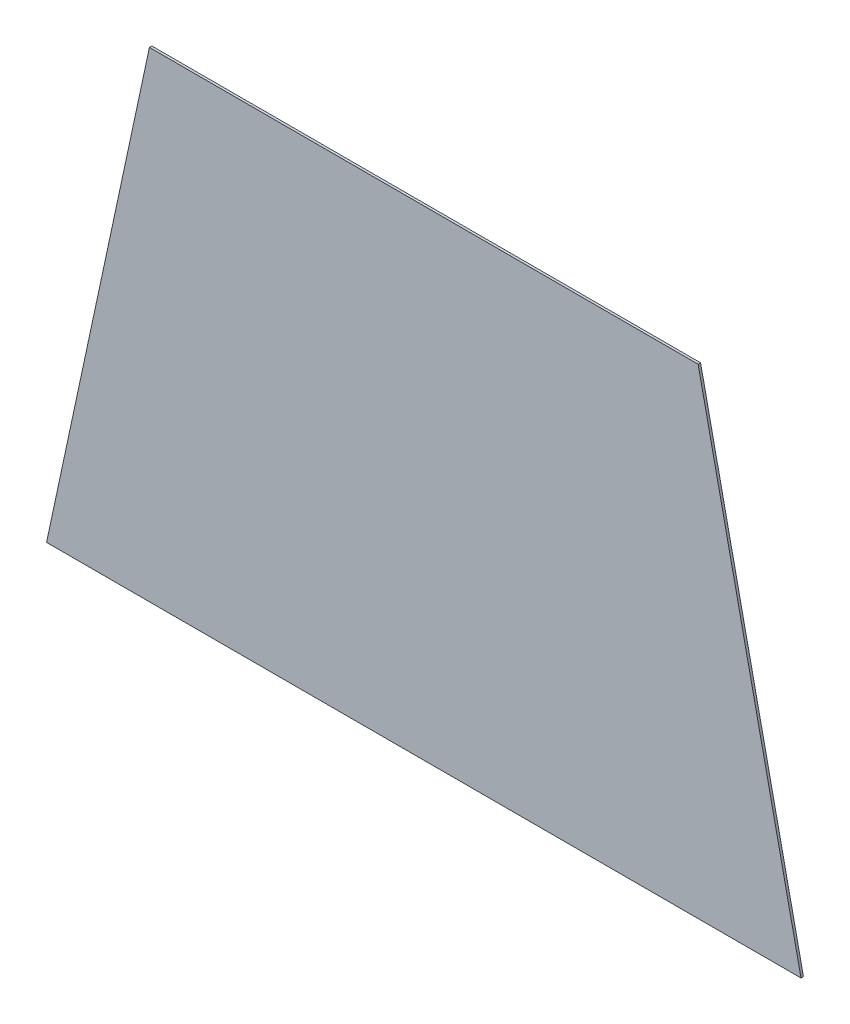
ISO-10303-21;
HEADER;
FILE_DESCRIPTION(('STEP AP214'),'2;1');
FILE_NAME('part.step','',(''),(''),'','','');
FILE_SCHEMA(('AUTOMOTIVE_DESIGN { 1 0 10303 214 1 1 1 1 }'));
ENDSEC;
DATA;
#1=APPLICATION_CONTEXT('core data for automotive mechanical design processes');
#2=APPLICATION_PROTOCOL_DEFINITION('international standard','automotive_design',2000,#1);
#3=PRODUCT_CONTEXT('',#1,'mechanical');
#4=PRODUCT('Part','Part','',(#3));
#5=PRODUCT_RELATED_PRODUCT_CATEGORY('part','',(#4));
#6=PRODUCT_DEFINITION_FORMATION('','',#4);
#7=PRODUCT_DEFINITION_CONTEXT('part definition',#1,'design');
#8=PRODUCT_DEFINITION('design','',#6,#7);
#9=PRODUCT_DEFINITION_SHAPE('','',#8);
#10=(LENGTH_UNIT() NAMED_UNIT(*) SI_UNIT(.MILLI.,.METRE.));
#11=(NAMED_UNIT(*) PLANE_ANGLE_UNIT() SI_UNIT($,.RADIAN.));
#12=(NAMED_UNIT(*) SI_UNIT($,.STERADIAN.) SOLID_ANGLE_UNIT());
#13=UNCERTAINTY_MEASURE_WITH_UNIT(LENGTH_MEASURE(1.E-05),#10,'distance_accuracy_value','');
#14=(GEOMETRIC_REPRESENTATION_CONTEXT(3) GLOBAL_UNCERTAINTY_ASSIGNED_CONTEXT((#13)) GLOBAL_UNIT_ASSIGNED_CONTEXT((#10,
#11,#12)) REPRESENTATION_CONTEXT('',''));
#15=CARTESIAN_POINT('',(0.,0.,0.));
#16=DIRECTION('',(0.,0.,1.));
#17=DIRECTION('',(1.,0.,0.));
#18=AXIS2_PLACEMENT_3D('',#15,#16,#17);
#19=CARTESIAN_POINT('',(177.8,311.15,0.));
#20=DIRECTION('',(0.97780241407741,0.209529088730873,0.));
#21=DIRECTION('',(-0.209529088730873,0.97780241407741,0.));
#22=AXIS2_PLACEMENT_3D('',#19,#20,#21);
#23=PLANE('',#22);
#24=DIRECTION('',(0.209529088730873,-0.97780241407741,0.));
#25=VECTOR('',#24,1.);
#26=CARTESIAN_POINT('',(177.8,311.15,1.5875));
#27=LINE('',#26,#25);
#28=CARTESIAN_POINT('',(177.8,311.15,1.5875));
#29=VERTEX_POINT('',#28);
#30=CARTESIAN_POINT('',(244.475,0.,1.5875));
#31=VERTEX_POINT('',#30);
#32=EDGE_CURVE('E9',#29,#31,#27,.T.);
#33=ORIENTED_EDGE('',*,*,#32,.T.);
#34=DIRECTION('',(0.,0.,1.));
#35=VECTOR('',#34,1.);
#36=CARTESIAN_POINT('',(244.475,0.,0.));
#37=LINE('',#36,#35);
#38=CARTESIAN_POINT('',(244.475,0.,0.));
#39=VERTEX_POINT('',#38);
#40=EDGE_CURVE('E34',#39,#31,#37,.T.);
#41=ORIENTED_EDGE('',*,*,#40,.F.);
#42=DIRECTION('',(0.209529088730873,-0.97780241407741,0.));
#43=VECTOR('',#42,1.);
#44=CARTESIAN_POINT('',(177.8,311.15,0.));
#45=LINE('',#44,#43);
#46=CARTESIAN_POINT('',(177.8,311.15,0.));
#47=VERTEX_POINT('',#46);
#48=EDGE_CURVE('E74',#47,#39,#45,.T.);
#49=ORIENTED_EDGE('',*,*,#48,.F.);
#50=DIRECTION('',(0.,0.,1.));
#51=VECTOR('',#50,1.);
#52=CARTESIAN_POINT('',(177.8,311.15,0.));
#53=LINE('',#52,#51);
#54=EDGE_CURVE('E25',#47,#29,#53,.T.);
#55=ORIENTED_EDGE('',*,*,#54,.T.);
#56=EDGE_LOOP('',(#33,#41,#49,#55));
#57=FACE_BOUND('',#56,.T.);
#58=ADVANCED_FACE('F15',(#57),#23,.T.);
#59=CARTESIAN_POINT('',(244.475,0.,0.));
#60=DIRECTION('',(0.,-1.,0.));
#61=DIRECTION('',(0.,0.,-1.));
#62=AXIS2_PLACEMENT_3D('',#59,#60,#61);
#63=PLANE('',#62);
#64=DIRECTION('',(-1.,0.,0.));
#65=VECTOR('',#64,1.);
#66=CARTESIAN_POINT('',(244.475,0.,1.5875));
#67=LINE('',#66,#65);
#68=CARTESIAN_POINT('',(-244.475,0.,1.5875));
#69=VERTEX_POINT('',#68);
#70=EDGE_CURVE('E80',#31,#69,#67,.T.);
#71=ORIENTED_EDGE('',*,*,#70,.T.);
#72=DIRECTION('',(0.,0.,1.));
#73=VECTOR('',#72,1.);
#74=CARTESIAN_POINT('',(-244.475,0.,0.));
#75=LINE('',#74,#73);
#76=CARTESIAN_POINT('',(-244.475,0.,0.));
#77=VERTEX_POINT('',#76);
#78=EDGE_CURVE('E82',#77,#69,#75,.T.);
#79=ORIENTED_EDGE('',*,*,#78,.F.);
#80=DIRECTION('',(-1.,0.,0.));
#81=VECTOR('',#80,1.);
#82=CARTESIAN_POINT('',(244.475,0.,0.));
#83=LINE('',#82,#81);
#84=EDGE_CURVE('E61',#39,#77,#83,.T.);
#85=ORIENTED_EDGE('',*,*,#84,.F.);
#86=ORIENTED_EDGE('',*,*,#40,.T.);
#87=EDGE_LOOP('',(#71,#79,#85,#86));
#88=FACE_BOUND('',#87,.T.);
#89=ADVANCED_FACE('F89',(#88),#63,.T.);
#90=CARTESIAN_POINT('',(-244.475,0.,0.));
#91=DIRECTION('',(-0.97780241407741,0.209529088730873,0.));
#92=DIRECTION('',(-0.209529088730873,-0.97780241407741,0.));
#93=AXIS2_PLACEMENT_3D('',#90,#91,#92);
#94=PLANE('',#93);
#95=DIRECTION('',(0.209529088730873,0.97780241407741,0.));
#96=VECTOR('',#95,1.);
#97=CARTESIAN_POINT('',(-244.475,0.,1.5875));
#98=LINE('',#97,#96);
#99=CARTESIAN_POINT('',(-177.8,311.15,1.5875));
#100=VERTEX_POINT('',#99);
#101=EDGE_CURVE('E67',#69,#100,#98,.T.);
#102=ORIENTED_EDGE('',*,*,#101,.T.);
#103=DIRECTION('',(0.,0.,1.));
#104=VECTOR('',#103,1.);
#105=CARTESIAN_POINT('',(-177.8,311.15,0.));
#106=LINE('',#105,#104);
#107=CARTESIAN_POINT('',(-177.8,311.15,0.));
#108=VERTEX_POINT('',#107);
#109=EDGE_CURVE('E54',#108,#100,#106,.T.);
#110=ORIENTED_EDGE('',*,*,#109,.F.);
#111=DIRECTION('',(0.209529088730873,0.97780241407741,0.));
#112=VECTOR('',#111,1.);
#113=CARTESIAN_POINT('',(-244.475,0.,0.));
#114=LINE('',#113,#112);
#115=EDGE_CURVE('E60',#77,#108,#114,.T.);
#116=ORIENTED_EDGE('',*,*,#115,.F.);
#117=ORIENTED_EDGE('',*,*,#78,.T.);
#118=EDGE_LOOP('',(#102,#110,#116,#117));
#119=FACE_BOUND('',#118,.T.);
#120=ADVANCED_FACE('F65',(#119),#94,.T.);
#121=CARTESIAN_POINT('',(-177.8,311.15,0.));
#122=DIRECTION('',(0.,1.,0.));
#123=DIRECTION('',(0.,0.,1.));
#124=AXIS2_PLACEMENT_3D('',#121,#122,#123);
#125=PLANE('',#124);
#126=DIRECTION('',(1.,0.,0.));
#127=VECTOR('',#126,1.);
#128=CARTESIAN_POINT('',(-177.8,311.15,1.5875));
#129=LINE('',#128,#127);
#130=EDGE_CURVE('E69',#100,#29,#129,.T.);
#131=ORIENTED_EDGE('',*,*,#130,.T.);
#132=ORIENTED_EDGE('',*,*,#54,.F.);
#133=DIRECTION('',(1.,0.,0.));
#134=VECTOR('',#133,1.);
#135=CARTESIAN_POINT('',(-177.8,311.15,0.));
#136=LINE('',#135,#134);
#137=EDGE_CURVE('E19',#108,#47,#136,.T.);
#138=ORIENTED_EDGE('',*,*,#137,.F.);
#139=ORIENTED_EDGE('',*,*,#109,.T.);
#140=EDGE_LOOP('',(#131,#132,#138,#139));
#141=FACE_BOUND('',#140,.T.);
#142=ADVANCED_FACE('F72',(#141),#125,.T.);
#143=CARTESIAN_POINT('',(0.,141.566730998447,1.5875));
#144=DIRECTION('',(0.,0.,1.));
#145=DIRECTION('',(1.,0.,0.));
#146=AXIS2_PLACEMENT_3D('',#143,#144,#145);
#147=PLANE('',#146);
#148=ORIENTED_EDGE('',*,*,#32,.F.);
#149=ORIENTED_EDGE('',*,*,#130,.F.);
#150=ORIENTED_EDGE('',*,*,#101,.F.);
#151=ORIENTED_EDGE('',*,*,#70,.F.);
#152=EDGE_LOOP('',(#148,#149,#150,#151));
#153=FACE_BOUND('',#152,.T.);
#154=ADVANCED_FACE('F86',(#153),#147,.T.);
#155=CARTESIAN_POINT('',(0.,141.566730998447,0.));
#156=DIRECTION('',(0.,0.,1.));
#157=DIRECTION('',(1.,0.,0.));
#158=AXIS2_PLACEMENT_3D('',#155,#156,#157);
#159=PLANE('',#158);
#160=ORIENTED_EDGE('',*,*,#137,.T.);
#161=ORIENTED_EDGE('',*,*,#48,.T.);
#162=ORIENTED_EDGE('',*,*,#84,.T.);
#163=ORIENTED_EDGE('',*,*,#115,.T.);
#164=EDGE_LOOP('',(#160,#161,#162,#163));
#165=FACE_BOUND('',#164,.T.);
#166=ADVANCED_FACE('F17',(#165),#159,.F.);
#167=CLOSED_SHELL('',(#58,#89,#120,#142,#154,#166));
#168=MANIFOLD_SOLID_BREP('B1',#167);
#169=ADVANCED_BREP_SHAPE_REPRESENTATION('',(#18,#168),#14);
#170=SHAPE_DEFINITION_REPRESENTATION(#9,#169);
ENDSEC;
END-ISO-10303-21;
